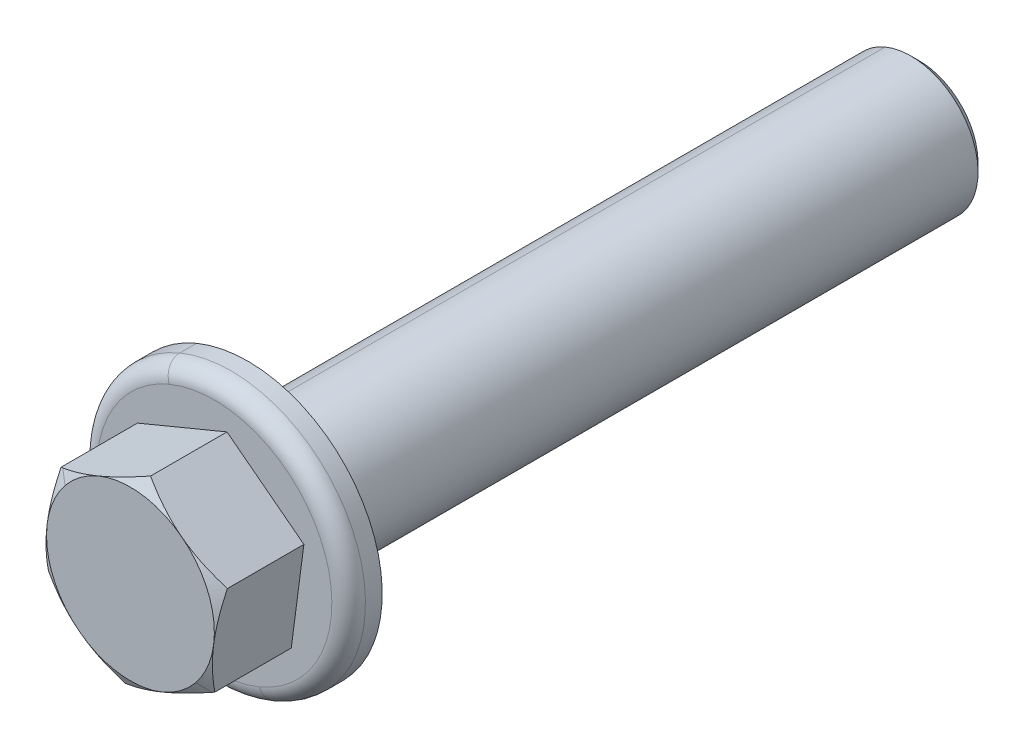
ISO-10303-21;
HEADER;
FILE_DESCRIPTION(('STEP AP214'),'2;1');
FILE_NAME('part.step','',(''),(''),'','','');
FILE_SCHEMA(('AUTOMOTIVE_DESIGN { 1 0 10303 214 1 1 1 1 }'));
ENDSEC;
DATA;
#1=APPLICATION_CONTEXT('core data for automotive mechanical design processes');
#2=APPLICATION_PROTOCOL_DEFINITION('international standard','automotive_design',2000,#1);
#3=PRODUCT_CONTEXT('',#1,'mechanical');
#4=PRODUCT('Part','Part','',(#3));
#5=PRODUCT_RELATED_PRODUCT_CATEGORY('part','',(#4));
#6=PRODUCT_DEFINITION_FORMATION('','',#4);
#7=PRODUCT_DEFINITION_CONTEXT('part definition',#1,'design');
#8=PRODUCT_DEFINITION('design','',#6,#7);
#9=PRODUCT_DEFINITION_SHAPE('','',#8);
#10=(LENGTH_UNIT() NAMED_UNIT(*) SI_UNIT(.MILLI.,.METRE.));
#11=(NAMED_UNIT(*) PLANE_ANGLE_UNIT() SI_UNIT($,.RADIAN.));
#12=(NAMED_UNIT(*) SI_UNIT($,.STERADIAN.) SOLID_ANGLE_UNIT());
#13=UNCERTAINTY_MEASURE_WITH_UNIT(LENGTH_MEASURE(1.E-05),#10,'distance_accuracy_value','');
#14=(GEOMETRIC_REPRESENTATION_CONTEXT(3) GLOBAL_UNCERTAINTY_ASSIGNED_CONTEXT((#13)) GLOBAL_UNIT_ASSIGNED_CONTEXT((#10,
#11,#12)) REPRESENTATION_CONTEXT('',''));
#15=CARTESIAN_POINT('',(0.,0.,0.));
#16=DIRECTION('',(0.,0.,1.));
#17=DIRECTION('',(1.,0.,0.));
#18=AXIS2_PLACEMENT_3D('',#15,#16,#17);
#19=CARTESIAN_POINT('',(104.,10.,26.1));
#20=DIRECTION('',(0.,0.,1.));
#21=DIRECTION('',(0.923728021347068,0.383049008063238,0.));
#22=AXIS2_PLACEMENT_3D('',#19,#20,#21);
#23=TOROIDAL_SURFACE('',#22,4.25,0.25);
#24=CARTESIAN_POINT('',(104.,10.,26.35));
#25=DIRECTION('',(0.,0.,-1.));
#26=DIRECTION('',(-0.923728021347068,-0.383049008063239,0.));
#27=AXIS2_PLACEMENT_3D('',#24,#25,#26);
#28=CIRCLE('',#27,4.25);
#29=CARTESIAN_POINT('',(105.627958284269,6.07415590927496,26.35));
#30=VERTEX_POINT('',#29);
#31=CARTESIAN_POINT('',(102.372041715731,13.925844090725,26.35));
#32=VERTEX_POINT('',#31);
#33=EDGE_CURVE('E11',#30,#32,#28,.T.);
#34=ORIENTED_EDGE('',*,*,#33,.T.);
#35=CARTESIAN_POINT('',(102.372041715731,13.925844090725,26.1));
#36=DIRECTION('',(0.923728021347068,0.383049008063238,0.));
#37=DIRECTION('',(0.,0.,1.));
#38=AXIS2_PLACEMENT_3D('',#35,#36,#37);
#39=CIRCLE('',#38,0.25);
#40=CARTESIAN_POINT('',(102.467803967747,13.6949120853883,26.1));
#41=VERTEX_POINT('',#40);
#42=EDGE_CURVE('E33',#32,#41,#39,.T.);
#43=ORIENTED_EDGE('',*,*,#42,.T.);
#44=CARTESIAN_POINT('',(104.,10.,26.1));
#45=DIRECTION('',(0.,0.,-1.));
#46=DIRECTION('',(-0.923728021347068,-0.383049008063238,0.));
#47=AXIS2_PLACEMENT_3D('',#44,#45,#46);
#48=CIRCLE('',#47,4.);
#49=CARTESIAN_POINT('',(105.532196032253,6.30508791461173,26.1));
#50=VERTEX_POINT('',#49);
#51=EDGE_CURVE('E461',#50,#41,#48,.T.);
#52=ORIENTED_EDGE('',*,*,#51,.F.);
#53=CARTESIAN_POINT('',(105.627958284269,6.07415590927496,26.1));
#54=DIRECTION('',(-0.923728021347068,-0.383049008063238,0.));
#55=DIRECTION('',(0.,0.,1.));
#56=AXIS2_PLACEMENT_3D('',#53,#54,#55);
#57=CIRCLE('',#56,0.25);
#58=EDGE_CURVE('E457',#30,#50,#57,.T.);
#59=ORIENTED_EDGE('',*,*,#58,.F.);
#60=EDGE_LOOP('',(#34,#43,#52,#59));
#61=FACE_BOUND('',#60,.T.);
#62=ADVANCED_FACE('F17',(#61),#23,.F.);
#63=CARTESIAN_POINT('',(104.,10.,26.1));
#64=DIRECTION('',(0.,0.,1.));
#65=DIRECTION('',(-0.383049008063238,0.923728021347068,0.));
#66=AXIS2_PLACEMENT_3D('',#63,#64,#65);
#67=TOROIDAL_SURFACE('',#66,4.25,0.25);
#68=CARTESIAN_POINT('',(104.,10.,26.35));
#69=DIRECTION('',(0.,0.,-1.));
#70=DIRECTION('',(-0.923728021347068,-0.383049008063239,0.));
#71=AXIS2_PLACEMENT_3D('',#68,#69,#70);
#72=CIRCLE('',#71,4.25);
#73=EDGE_CURVE('E454',#32,#30,#72,.T.);
#74=ORIENTED_EDGE('',*,*,#73,.T.);
#75=ORIENTED_EDGE('',*,*,#58,.T.);
#76=CARTESIAN_POINT('',(104.,10.,26.1));
#77=DIRECTION('',(0.,0.,-1.));
#78=DIRECTION('',(-0.923728021347068,-0.383049008063238,0.));
#79=AXIS2_PLACEMENT_3D('',#76,#77,#78);
#80=CIRCLE('',#79,4.);
#81=EDGE_CURVE('E465',#41,#50,#80,.T.);
#82=ORIENTED_EDGE('',*,*,#81,.F.);
#83=ORIENTED_EDGE('',*,*,#42,.F.);
#84=EDGE_LOOP('',(#74,#75,#82,#83));
#85=FACE_BOUND('',#84,.T.);
#86=ADVANCED_FACE('F311',(#85),#67,.F.);
#87=CARTESIAN_POINT('',(104.,10.,6.35));
#88=DIRECTION('',(0.,0.,1.));
#89=DIRECTION('',(0.923728021347068,0.383049008063238,0.));
#90=AXIS2_PLACEMENT_3D('',#87,#88,#89);
#91=CYLINDRICAL_SURFACE('',#90,4.);
#92=DIRECTION('',(0.,0.,-1.));
#93=VECTOR('',#92,1.);
#94=CARTESIAN_POINT('',(105.532196032253,6.30508791461173,6.35));
#95=LINE('',#94,#93);
#96=CARTESIAN_POINT('',(105.532196032253,6.30508791461173,-13.15));
#97=VERTEX_POINT('',#96);
#98=EDGE_CURVE('E468',#50,#97,#95,.T.);
#99=ORIENTED_EDGE('',*,*,#98,.F.);
#100=ORIENTED_EDGE('',*,*,#51,.T.);
#101=DIRECTION('',(0.,0.,-1.));
#102=VECTOR('',#101,1.);
#103=CARTESIAN_POINT('',(102.467803967747,13.6949120853883,6.35));
#104=LINE('',#103,#102);
#105=CARTESIAN_POINT('',(102.467803967747,13.6949120853883,-13.15));
#106=VERTEX_POINT('',#105);
#107=EDGE_CURVE('E472',#41,#106,#104,.T.);
#108=ORIENTED_EDGE('',*,*,#107,.T.);
#109=CARTESIAN_POINT('',(104.,10.,-13.15));
#110=DIRECTION('',(0.,0.,1.));
#111=DIRECTION('',(-0.923728021347068,-0.383049008063238,0.));
#112=AXIS2_PLACEMENT_3D('',#109,#110,#111);
#113=CIRCLE('',#112,4.);
#114=EDGE_CURVE('E467',#106,#97,#113,.T.);
#115=ORIENTED_EDGE('',*,*,#114,.T.);
#116=EDGE_LOOP('',(#99,#100,#108,#115));
#117=FACE_BOUND('',#116,.T.);
#118=ADVANCED_FACE('F317',(#117),#91,.T.);
#119=CARTESIAN_POINT('',(104.,10.,6.35));
#120=DIRECTION('',(0.,0.,1.));
#121=DIRECTION('',(0.923728021347068,0.383049008063238,0.));
#122=AXIS2_PLACEMENT_3D('',#119,#120,#121);
#123=CYLINDRICAL_SURFACE('',#122,4.);
#124=ORIENTED_EDGE('',*,*,#107,.F.);
#125=ORIENTED_EDGE('',*,*,#81,.T.);
#126=ORIENTED_EDGE('',*,*,#98,.T.);
#127=CARTESIAN_POINT('',(104.,10.,-13.15));
#128=DIRECTION('',(0.,0.,1.));
#129=DIRECTION('',(-0.923728021347068,-0.383049008063238,0.));
#130=AXIS2_PLACEMENT_3D('',#127,#128,#129);
#131=CIRCLE('',#130,4.);
#132=EDGE_CURVE('E471',#97,#106,#131,.T.);
#133=ORIENTED_EDGE('',*,*,#132,.T.);
#134=EDGE_LOOP('',(#124,#125,#126,#133));
#135=FACE_BOUND('',#134,.T.);
#136=ADVANCED_FACE('F322',(#135),#123,.T.);
#137=CARTESIAN_POINT('',(104.,10.,-17.15));
#138=DIRECTION('',(0.,0.,1.));
#139=DIRECTION('',(-0.114958388351689,0.993370308066223,0.));
#140=AXIS2_PLACEMENT_3D('',#137,#138,#139);
#141=CONICAL_SURFACE('',#140,0.,0.785398163396999);
#142=DIRECTION('',(0.270856393052956,-0.653174413416782,-0.707106781186537));
#143=VECTOR('',#142,1.);
#144=CARTESIAN_POINT('',(102.563567058084,13.4639804276842,-13.4));
#145=LINE('',#144,#143);
#146=CARTESIAN_POINT('',(102.659328713789,13.2330481750709,-13.65));
#147=VERTEX_POINT('',#146);
#148=EDGE_CURVE('E478',#106,#147,#145,.T.);
#149=ORIENTED_EDGE('',*,*,#148,.T.);
#150=CARTESIAN_POINT('',(104.,10.,-13.65));
#151=DIRECTION('',(0.,0.,1.));
#152=DIRECTION('',(0.993370308066188,0.114958388351986,0.));
#153=AXIS2_PLACEMENT_3D('',#150,#151,#152);
#154=CIRCLE('',#153,3.5);
#155=CARTESIAN_POINT('',(105.340671528221,6.76695192528526,-13.65));
#156=VERTEX_POINT('',#155);
#157=EDGE_CURVE('E481',#147,#156,#154,.T.);
#158=ORIENTED_EDGE('',*,*,#157,.T.);
#159=DIRECTION('',(-0.270856551128283,0.65317434786655,-0.707106781186547));
#160=VECTOR('',#159,1.);
#161=CARTESIAN_POINT('',(105.436433780237,6.53601991994849,-13.4));
#162=LINE('',#161,#160);
#163=EDGE_CURVE('E484',#97,#156,#162,.T.);
#164=ORIENTED_EDGE('',*,*,#163,.F.);
#165=ORIENTED_EDGE('',*,*,#114,.F.);
#166=EDGE_LOOP('',(#149,#158,#164,#165));
#167=FACE_BOUND('',#166,.T.);
#168=ADVANCED_FACE('F326',(#167),#141,.T.);
#169=CARTESIAN_POINT('',(104.,10.0000000000012,-17.15));
#170=DIRECTION('',(-2.07112037355488E-13,-2.99341000002082E-13,1.));
#171=DIRECTION('',(0.383049008063238,-0.923728021347068,-1.97175609173E-13));
#172=AXIS2_PLACEMENT_3D('',#169,#170,#171);
#173=CONICAL_SURFACE('',#172,0.,0.785398163396999);
#174=ORIENTED_EDGE('',*,*,#163,.T.);
#175=CARTESIAN_POINT('',(104.,10.,-13.6499999999993));
#176=DIRECTION('',(-2.8263995886347E-13,-1.17204364682804E-13,1.));
#177=DIRECTION('',(0.923728021347068,0.383049008063238,3.05977465587E-13));
#178=AXIS2_PLACEMENT_3D('',#175,#176,#177);
#179=CIRCLE('',#178,3.5);
#180=EDGE_CURVE('E352',#156,#147,#179,.T.);
#181=ORIENTED_EDGE('',*,*,#180,.T.);
#182=ORIENTED_EDGE('',*,*,#148,.F.);
#183=ORIENTED_EDGE('',*,*,#132,.F.);
#184=EDGE_LOOP('',(#174,#181,#182,#183));
#185=FACE_BOUND('',#184,.T.);
#186=ADVANCED_FACE('F330',(#185),#173,.T.);
#187=CARTESIAN_POINT('',(104.,10.,-13.65));
#188=DIRECTION('',(0.,0.,1.));
#189=DIRECTION('',(-0.383049008063238,0.923728021347068,0.));
#190=AXIS2_PLACEMENT_3D('',#187,#188,#189);
#191=PLANE('',#190);
#192=ORIENTED_EDGE('',*,*,#180,.F.);
#193=ORIENTED_EDGE('',*,*,#157,.F.);
#194=EDGE_LOOP('',(#192,#193));
#195=FACE_BOUND('',#194,.T.);
#196=ADVANCED_FACE('F334',(#195),#191,.F.);
#197=CARTESIAN_POINT('',(104.,10.,33.35));
#198=DIRECTION('',(0.,0.,1.));
#199=DIRECTION('',(0.923728021347068,0.383049008063238,0.));
#200=AXIS2_PLACEMENT_3D('',#197,#198,#199);
#201=PLANE('',#200);
#202=CARTESIAN_POINT('',(104.,10.,33.35));
#203=DIRECTION('',(0.,0.,1.));
#204=DIRECTION('',(-0.923728021347068,-0.383049008063239,0.));
#205=AXIS2_PLACEMENT_3D('',#202,#203,#204);
#206=CIRCLE('',#205,5.);
#207=CARTESIAN_POINT('',(108.95748218353,9.3493308060171,33.3499999999993));
#208=VERTEX_POINT('',#207);
#209=CARTESIAN_POINT('',(107.042237143212,13.9679709127555,33.3499999999992));
#210=VERTEX_POINT('',#209);
#211=EDGE_CURVE('E347',#208,#210,#206,.T.);
#212=ORIENTED_EDGE('',*,*,#211,.T.);
#213=CARTESIAN_POINT('',(104.,10.,33.35));
#214=DIRECTION('',(0.,0.,1.));
#215=DIRECTION('',(-0.923728021347068,-0.383049008063239,0.));
#216=AXIS2_PLACEMENT_3D('',#213,#214,#215);
#217=CIRCLE('',#216,5.);
#218=CARTESIAN_POINT('',(102.084754959684,14.6186401067354,33.35));
#219=VERTEX_POINT('',#218);
#220=EDGE_CURVE('E353',#210,#219,#217,.T.);
#221=ORIENTED_EDGE('',*,*,#220,.T.);
#222=CARTESIAN_POINT('',(104.,10.,33.35));
#223=DIRECTION('',(0.,0.,1.));
#224=DIRECTION('',(-0.923728021347068,-0.383049008063239,0.));
#225=AXIS2_PLACEMENT_3D('',#222,#223,#224);
#226=CIRCLE('',#225,5.);
#227=CARTESIAN_POINT('',(100.104920330083,13.1350206323045,33.35));
#228=VERTEX_POINT('',#227);
#229=EDGE_CURVE('E368',#219,#228,#226,.T.);
#230=ORIENTED_EDGE('',*,*,#229,.T.);
#231=CARTESIAN_POINT('',(104.,10.,33.35));
#232=DIRECTION('',(0.,0.,1.));
#233=DIRECTION('',(-0.923728021347068,-0.383049008063239,0.));
#234=AXIS2_PLACEMENT_3D('',#231,#232,#233);
#235=CIRCLE('',#234,5.);
#236=CARTESIAN_POINT('',(99.0425178164704,10.6506691939829,33.3499999999994));
#237=VERTEX_POINT('',#236);
#238=EDGE_CURVE('E372',#228,#237,#235,.T.);
#239=ORIENTED_EDGE('',*,*,#238,.T.);
#240=CARTESIAN_POINT('',(104.,10.,33.35));
#241=DIRECTION('',(0.,0.,1.));
#242=DIRECTION('',(-0.923728021347068,-0.383049008063239,0.));
#243=AXIS2_PLACEMENT_3D('',#240,#241,#242);
#244=CIRCLE('',#243,5.);
#245=CARTESIAN_POINT('',(100.957762856788,6.03202908724451,33.3499999999993));
#246=VERTEX_POINT('',#245);
#247=EDGE_CURVE('E172',#237,#246,#244,.T.);
#248=ORIENTED_EDGE('',*,*,#247,.T.);
#249=CARTESIAN_POINT('',(104.,10.,33.35));
#250=DIRECTION('',(0.,0.,1.));
#251=DIRECTION('',(-0.923728021347068,-0.383049008063239,0.));
#252=AXIS2_PLACEMENT_3D('',#249,#250,#251);
#253=CIRCLE('',#252,5.);
#254=CARTESIAN_POINT('',(105.915245040316,5.38135989326459,33.35));
#255=VERTEX_POINT('',#254);
#256=EDGE_CURVE('E147',#246,#255,#253,.T.);
#257=ORIENTED_EDGE('',*,*,#256,.T.);
#258=CARTESIAN_POINT('',(104.,10.,33.35));
#259=DIRECTION('',(0.,0.,1.));
#260=DIRECTION('',(-0.923728021347068,-0.383049008063239,0.));
#261=AXIS2_PLACEMENT_3D('',#258,#259,#260);
#262=CIRCLE('',#261,5.);
#263=CARTESIAN_POINT('',(107.895079669917,6.86497936769553,33.35));
#264=VERTEX_POINT('',#263);
#265=EDGE_CURVE('E160',#255,#264,#262,.T.);
#266=ORIENTED_EDGE('',*,*,#265,.T.);
#267=CARTESIAN_POINT('',(104.,10.,33.35));
#268=DIRECTION('',(0.,0.,1.));
#269=DIRECTION('',(-0.923728021347068,-0.383049008063239,0.));
#270=AXIS2_PLACEMENT_3D('',#267,#268,#269);
#271=CIRCLE('',#270,5.);
#272=EDGE_CURVE('E166',#264,#208,#271,.T.);
#273=ORIENTED_EDGE('',*,*,#272,.T.);
#274=EDGE_LOOP('',(#212,#221,#230,#239,#248,#257,#266,#273));
#275=FACE_BOUND('',#274,.T.);
#276=ADVANCED_FACE('F169',(#275),#201,.T.);
#277=CARTESIAN_POINT('',(104.,10.,33.35));
#278=DIRECTION('',(0.,0.,-1.));
#279=DIRECTION('',(0.779015933983816,-0.62700412646116,0.));
#280=AXIS2_PLACEMENT_3D('',#277,#278,#279);
#281=CONICAL_SURFACE('',#280,5.,1.0471975512);
#282=ORIENTED_EDGE('',*,*,#211,.F.);
#283=CARTESIAN_POINT('',(109.333146217831,12.2115344791841,32.9034180126157));
#284=CARTESIAN_POINT('',(109.3025673255,11.9785523197016,32.9712680083951));
#285=CARTESIAN_POINT('',(109.271743546411,11.7437043553627,33.0334304503107));
#286=CARTESIAN_POINT('',(109.209824279666,11.2719382650976,33.1430527974047));
#287=CARTESIAN_POINT('',(109.178730951812,11.0350365947981,33.1905854034298));
#288=CARTESIAN_POINT('',(109.131797514476,10.677448312528,33.2489473736346));
#289=CARTESIAN_POINT('',(109.11609374839,10.557800507916,33.2662522919641));
#290=CARTESIAN_POINT('',(109.084611035887,10.3179320958806,33.2962074663214));
#291=CARTESIAN_POINT('',(109.068832091461,10.1977115036178,33.3088578448603));
#292=CARTESIAN_POINT('',(109.037140657916,9.95625283518837,33.3292816727013));
#293=CARTESIAN_POINT('',(109.021227896041,9.83501268087028,33.3370303207408));
#294=CARTESIAN_POINT('',(108.989371077041,9.59229393211747,33.3474002095296));
#295=CARTESIAN_POINT('',(108.973427014344,9.47081529522707,33.3500204348121));
#296=CARTESIAN_POINT('',(108.957482183531,9.34933080601693,33.3499999999985));
#297=B_SPLINE_CURVE_WITH_KNOTS('',3,(#283,#284,#285,#286,#287,#288,#289,#290,#291,#292,#293,
#294,#295,#296),.UNSPECIFIED.,.F.,.F.,(4,2,2,2,2,2,4),(0.,0.734036658391592,1.46436443241699,
1.8300074907837,2.1956409244586,2.56310985866725,2.93065154716807),.UNSPECIFIED.);
#298=CARTESIAN_POINT('',(109.333146217831,12.211534479183,32.9034180126157));
#299=VERTEX_POINT('',#298);
#300=EDGE_CURVE('E218',#299,#208,#297,.T.);
#301=ORIENTED_EDGE('',*,*,#300,.F.);
#302=CARTESIAN_POINT('',(107.042237143213,13.9679709127566,33.3499999999985));
#303=CARTESIAN_POINT('',(107.139473381628,13.8934200396083,33.3500204348121));
#304=CARTESIAN_POINT('',(107.236704935844,13.8188727578283,33.3474002095296));
#305=CARTESIAN_POINT('',(107.430977128739,13.6699245689144,33.3370303207408));
#306=CARTESIAN_POINT('',(107.5280178014,13.5955236357268,33.3292816727013));
#307=CARTESIAN_POINT('',(107.721281425451,13.4473487149803,33.3088578448603));
#308=CARTESIAN_POINT('',(107.817506040196,13.373573452131,33.2962074663214));
#309=CARTESIAN_POINT('',(108.009496822333,13.226374417306,33.2662522919641));
#310=CARTESIAN_POINT('',(108.10526297759,13.1529506546339,33.2489473736346));
#311=CARTESIAN_POINT('',(108.391476795464,12.9335109644795,33.1905854034297));
#312=CARTESIAN_POINT('',(108.581092996215,12.7881325175194,33.1430527974047));
#313=CARTESIAN_POINT('',(108.958694781657,12.4986258144028,33.0334304503107));
#314=CARTESIAN_POINT('',(109.146667195257,12.3545076565013,32.9712680083951));
#315=CARTESIAN_POINT('',(109.333146217832,12.211534479182,32.9034180126156));
#316=B_SPLINE_CURVE_WITH_KNOTS('',3,(#302,#303,#304,#305,#306,#307,#308,#309,#310,#311,#312,
#313,#314,#315),.UNSPECIFIED.,.F.,.F.,(4,2,2,2,2,2,4),(0.,0.36754168850086,0.735010622709554,
1.10064405638449,1.46628711475127,2.19661488877674,2.93065154716843),.UNSPECIFIED.);
#317=EDGE_CURVE('E234',#210,#299,#316,.T.);
#318=ORIENTED_EDGE('',*,*,#317,.F.);
#319=EDGE_LOOP('',(#282,#301,#318));
#320=FACE_BOUND('',#319,.T.);
#321=ADVANCED_FACE('F248',(#320),#281,.T.);
#322=CARTESIAN_POINT('',(104.,10.,33.35));
#323=DIRECTION('',(0.,0.,-1.));
#324=DIRECTION('',(0.779015933983816,-0.62700412646116,0.));
#325=AXIS2_PLACEMENT_3D('',#322,#323,#324);
#326=CONICAL_SURFACE('',#325,5.,1.0471975512);
#327=ORIENTED_EDGE('',*,*,#220,.F.);
#328=CARTESIAN_POINT('',(104.751328068599,15.7244073463278,32.9034180126172));
#329=CARTESIAN_POINT('',(104.937807091173,15.5814341690087,32.9712680083964));
#330=CARTESIAN_POINT('',(105.125779504773,15.4373160111075,33.0334304503118));
#331=CARTESIAN_POINT('',(105.503381290214,15.1478093079915,33.1430527974054));
#332=CARTESIAN_POINT('',(105.692997490964,15.0024308610316,33.1905854034303));
#333=CARTESIAN_POINT('',(105.979211308838,14.7829911708776,33.248947373635));
#334=CARTESIAN_POINT('',(106.074977464095,14.7095674082057,33.2662522919644));
#335=CARTESIAN_POINT('',(106.266968246232,14.562368373381,33.2962074663216));
#336=CARTESIAN_POINT('',(106.363192860976,14.4885931105318,33.3088578448604));
#337=CARTESIAN_POINT('',(106.556456485027,14.3404181897856,33.3292816727013));
#338=CARTESIAN_POINT('',(106.653497157688,14.2660172565982,33.3370303207408));
#339=CARTESIAN_POINT('',(106.847769350582,14.1170690676846,33.3474002095296));
#340=CARTESIAN_POINT('',(106.945000904798,14.0425217859048,33.3500204348121));
#341=CARTESIAN_POINT('',(107.042237143213,13.9679709127566,33.3499999999985));
#342=B_SPLINE_CURVE_WITH_KNOTS('',3,(#328,#329,#330,#331,#332,#333,#334,#335,#336,#337,#338,
#339,#340,#341),.UNSPECIFIED.,.F.,.F.,(4,2,2,2,2,2,4),(0.,0.734036658390187,1.46436443241421,
1.83000749078021,2.19564092445442,2.56310985866234,2.93065154716248),.UNSPECIFIED.);
#343=CARTESIAN_POINT('',(104.7513280686,15.7244073463277,32.9034180126172));
#344=VERTEX_POINT('',#343);
#345=EDGE_CURVE('E225',#344,#210,#342,.T.);
#346=ORIENTED_EDGE('',*,*,#345,.F.);
#347=CARTESIAN_POINT('',(102.084754959684,14.6186401067355,33.35));
#348=CARTESIAN_POINT('',(102.197936028912,14.6655737227973,33.3500204348137));
#349=CARTESIAN_POINT('',(102.311111645825,14.7125050779077,33.3474002095312));
#350=CARTESIAN_POINT('',(102.537240657719,14.8062756377465,33.3370303207423));
#351=CARTESIAN_POINT('',(102.650194092255,14.853114858877,33.3292816727028));
#352=CARTESIAN_POINT('',(102.875149149851,14.9463986065599,33.3088578448618));
#353=CARTESIAN_POINT('',(102.987152709022,14.9928439359733,33.2962074663229));
#354=CARTESIAN_POINT('',(103.210626203661,15.0855133131837,33.2662522919656));
#355=CARTESIAN_POINT('',(103.322096125006,15.1317373551237,33.2489473736361));
#356=CARTESIAN_POINT('',(103.655243380215,15.2698859472393,33.1905854034312));
#357=CARTESIAN_POINT('',(103.87595290882,15.3614091705786,33.1430527974062));
#358=CARTESIAN_POINT('',(104.315473961006,15.5436685577271,33.0334304503122));
#359=CARTESIAN_POINT('',(104.534270153695,15.6343983641645,32.9712680083965));
#360=CARTESIAN_POINT('',(104.751328068601,15.7244073463275,32.9034180126171));
#361=B_SPLINE_CURVE_WITH_KNOTS('',3,(#347,#348,#349,#350,#351,#352,#353,#354,#355,#356,#357,
#358,#359,#360),.UNSPECIFIED.,.F.,.F.,(4,2,2,2,2,2,4),(0.,0.367541688500738,0.735010622709312,
1.10064405638414,1.46628711475077,2.19661488877601,2.93065154716746),.UNSPECIFIED.);
#362=EDGE_CURVE('E256',#219,#344,#361,.T.);
#363=ORIENTED_EDGE('',*,*,#362,.F.);
#364=EDGE_LOOP('',(#327,#346,#363));
#365=FACE_BOUND('',#364,.T.);
#366=ADVANCED_FACE('F243',(#365),#326,.T.);
#367=CARTESIAN_POINT('',(104.,10.,33.35));
#368=DIRECTION('',(0.,0.,-1.));
#369=DIRECTION('',(0.779015933983816,-0.62700412646116,0.));
#370=AXIS2_PLACEMENT_3D('',#367,#368,#369);
#371=CONICAL_SURFACE('',#370,5.,1.0471975512);
#372=DIRECTION('',(0.674647588782705,-0.543001501793055,0.500000000000169));
#373=VECTOR('',#372,1.);
#374=CARTESIAN_POINT('',(98.3669224154155,14.5338775962476,32.0619216436));
#375=LINE('',#374,#373);
#376=CARTESIAN_POINT('',(99.5615803696797,13.5723369725487,32.947315717563));
#377=VERTEX_POINT('',#376);
#378=EDGE_CURVE('E359',#377,#228,#375,.T.);
#379=ORIENTED_EDGE('',*,*,#378,.T.);
#380=ORIENTED_EDGE('',*,*,#229,.F.);
#381=CARTESIAN_POINT('',(99.5615803696752,13.5723369725545,32.9473157175507));
#382=CARTESIAN_POINT('',(99.7673217148021,13.6576532305251,33.0089939702822));
#383=CARTESIAN_POINT('',(99.9746224299532,13.743616123793,33.0652901400361));
#384=CARTESIAN_POINT('',(100.390932907383,13.9162506133173,33.164327519033));
#385=CARTESIAN_POINT('',(100.599930196708,14.0029170373233,33.2071306974177));
#386=CARTESIAN_POINT('',(100.915212095264,14.1336572722318,33.2595623012601));
#387=CARTESIAN_POINT('',(101.02066262896,14.1773852109739,33.275082637656));
#388=CARTESIAN_POINT('',(101.232020427228,14.2650304843684,33.3019229351795));
#389=CARTESIAN_POINT('',(101.337927683107,14.3089478154156,33.3132429759078));
#390=CARTESIAN_POINT('',(101.550560143613,14.3971216622587,33.3315033490443));
#391=CARTESIAN_POINT('',(101.657286864002,14.4413788066065,33.3384231328081));
#392=CARTESIAN_POINT('',(101.870925975233,14.5299700886173,33.3476799879821));
#393=CARTESIAN_POINT('',(101.977838392784,14.574304237356,33.3500163340106));
#394=CARTESIAN_POINT('',(102.084754959684,14.6186401067355,33.35));
#395=B_SPLINE_CURVE_WITH_KNOTS('',3,(#381,#382,#383,#384,#385,#386,#387,#388,#389,#390,#391,
#392,#393,#394),.UNSPECIFIED.,.F.,.F.,(4,2,2,2,2,2,4),(0.,0.6935727097251,1.38391201165256,
1.7294646913559,2.07501082206955,2.42215898329313,2.7693620802709),.UNSPECIFIED.);
#396=EDGE_CURVE('E262',#377,#219,#395,.T.);
#397=ORIENTED_EDGE('',*,*,#396,.F.);
#398=EDGE_LOOP('',(#379,#380,#397));
#399=FACE_BOUND('',#398,.T.);
#400=ADVANCED_FACE('F247',(#399),#371,.T.);
#401=CARTESIAN_POINT('',(104.,10.,33.35));
#402=DIRECTION('',(0.,0.,-1.));
#403=DIRECTION('',(0.779015933983816,-0.62700412646116,0.));
#404=AXIS2_PLACEMENT_3D('',#401,#402,#403);
#405=CONICAL_SURFACE('',#404,5.,1.0471975512);
#406=ORIENTED_EDGE('',*,*,#238,.F.);
#407=ORIENTED_EDGE('',*,*,#378,.F.);
#408=CARTESIAN_POINT('',(99.5615803696809,13.5723369725492,32.9473157175));
#409=CARTESIAN_POINT('',(99.5144006273216,13.5527726060974,32.9331782382));
#410=CARTESIAN_POINT('',(99.466617991441,13.5329582334101,32.9185548376));
#411=CARTESIAN_POINT('',(99.4181818507684,13.512872867144,32.9034180126));
#412=B_SPLINE_CURVE_WITH_KNOTS('',3,(#408,#409,#410,#411),.UNSPECIFIED.,.F.,.F.,(4,4),(0.,1.),.UNSPECIFIED.);
#413=CARTESIAN_POINT('',(99.4181818507687,13.5128728671463,32.9034180126082));
#414=VERTEX_POINT('',#413);
#415=EDGE_CURVE('E362',#377,#414,#412,.T.);
#416=ORIENTED_EDGE('',*,*,#415,.T.);
#417=CARTESIAN_POINT('',(99.0425178164693,10.650669193983,33.3499999999987));
#418=CARTESIAN_POINT('',(99.0584626472825,10.7721536831931,33.3500204348124));
#419=CARTESIAN_POINT('',(99.0744067099791,10.8936323200835,33.3474002095299));
#420=CARTESIAN_POINT('',(99.1062635289789,11.1363510688361,33.3370303207411));
#421=CARTESIAN_POINT('',(99.1221762908544,11.2575912231542,33.3292816727016));
#422=CARTESIAN_POINT('',(99.1538677243988,11.4990498915834,33.3088578448606));
#423=CARTESIAN_POINT('',(99.169646668825,11.6192704838461,33.2962074663217));
#424=CARTESIAN_POINT('',(99.2011293813276,11.8591388958814,33.2662522919645));
#425=CARTESIAN_POINT('',(99.2168331474143,11.9787867004934,33.248947373635));
#426=CARTESIAN_POINT('',(99.2637665847497,12.3363749827633,33.1905854034302));
#427=CARTESIAN_POINT('',(99.2948599126046,12.5732766530627,33.1430527974052));
#428=CARTESIAN_POINT('',(99.3567791793486,13.0450427433275,33.0334304503113));
#429=CARTESIAN_POINT('',(99.387602958438,13.2798907076663,32.9712680083957));
#430=CARTESIAN_POINT('',(99.418181850769,13.5128728671486,32.9034180126164));
#431=B_SPLINE_CURVE_WITH_KNOTS('',3,(#417,#418,#419,#420,#421,#422,#423,#424,#425,#426,#427,
#428,#429,#430),.UNSPECIFIED.,.F.,.F.,(4,2,2,2,2,2,4),(0.,0.367541688500622,0.735010622709061,
1.10064405638375,1.46628711475027,2.19661488877527,2.93065154716645),.UNSPECIFIED.);
#432=EDGE_CURVE('E287',#237,#414,#431,.T.);
#433=ORIENTED_EDGE('',*,*,#432,.F.);
#434=EDGE_LOOP('',(#406,#407,#416,#433));
#435=FACE_BOUND('',#434,.T.);
#436=ADVANCED_FACE('F297',(#435),#405,.T.);
#437=CARTESIAN_POINT('',(104.,10.,33.35));
#438=DIRECTION('',(0.,0.,-1.));
#439=DIRECTION('',(0.779015933983816,-0.62700412646116,0.));
#440=AXIS2_PLACEMENT_3D('',#437,#438,#439);
#441=CONICAL_SURFACE('',#440,5.,1.0471975512);
#442=ORIENTED_EDGE('',*,*,#247,.F.);
#443=CARTESIAN_POINT('',(98.6668537821694,7.78846552081587,32.9034180126159));
#444=CARTESIAN_POINT('',(98.6974326745004,8.02144768029834,32.9712680083953));
#445=CARTESIAN_POINT('',(98.7282564535898,8.25629564463727,33.0334304503109));
#446=CARTESIAN_POINT('',(98.7901757203339,8.72806173490236,33.1430527974049));
#447=CARTESIAN_POINT('',(98.8212690481888,8.96496340520186,33.19058540343));
#448=CARTESIAN_POINT('',(98.8682024855243,9.32255168747195,33.2489473736349));
#449=CARTESIAN_POINT('',(98.8839062516109,9.44219949208399,33.2662522919644));
#450=CARTESIAN_POINT('',(98.9153889641135,9.68206790411939,33.2962074663217));
#451=CARTESIAN_POINT('',(98.9311679085397,9.80228849638217,33.3088578448605));
#452=CARTESIAN_POINT('',(98.9628593420842,10.0437471648116,33.3292816727015));
#453=CARTESIAN_POINT('',(98.9787721039597,10.1649873191297,33.3370303207411));
#454=CARTESIAN_POINT('',(99.0106289229595,10.4077060678825,33.3474002095299));
#455=CARTESIAN_POINT('',(99.0265729856561,10.5291847047729,33.3500204348124));
#456=CARTESIAN_POINT('',(99.0425178164693,10.650669193983,33.3499999999987));
#457=B_SPLINE_CURVE_WITH_KNOTS('',3,(#443,#444,#445,#446,#447,#448,#449,#450,#451,#452,#453,
#454,#455,#456),.UNSPECIFIED.,.F.,.F.,(4,2,2,2,2,2,4),(0.,0.734036658391598,1.46436443241701,
1.83000749078372,2.19564092445863,2.56310985866727,2.9306515471681),.UNSPECIFIED.);
#458=CARTESIAN_POINT('',(98.6668537821689,7.78846552081692,32.9034180126159));
#459=VERTEX_POINT('',#458);
#460=EDGE_CURVE('E268',#459,#237,#457,.T.);
#461=ORIENTED_EDGE('',*,*,#460,.F.);
#462=CARTESIAN_POINT('',(100.957762856787,6.03202908724346,33.3499999999985));
#463=CARTESIAN_POINT('',(100.860526618372,6.10657996039178,33.3500204348122));
#464=CARTESIAN_POINT('',(100.763295064156,6.18112724217176,33.3474002095297));
#465=CARTESIAN_POINT('',(100.569022871261,6.3300754310857,33.3370303207409));
#466=CARTESIAN_POINT('',(100.471982198601,6.40447636427326,33.3292816727013));
#467=CARTESIAN_POINT('',(100.278718574549,6.55265128501973,33.3088578448604));
#468=CARTESIAN_POINT('',(100.182493959804,6.62642654786907,33.2962074663215));
#469=CARTESIAN_POINT('',(99.9905031776675,6.77362558269401,33.2662522919642));
#470=CARTESIAN_POINT('',(99.8947370224098,6.84704934536609,33.2489473736347));
#471=CARTESIAN_POINT('',(99.6085232045359,7.06648903552045,33.1905854034298));
#472=CARTESIAN_POINT('',(99.4189070037849,7.21186748248061,33.1430527974048));
#473=CARTESIAN_POINT('',(99.0413052183432,7.50137418559712,33.0334304503108));
#474=CARTESIAN_POINT('',(98.8533328047433,7.64549234349859,32.9712680083952));
#475=CARTESIAN_POINT('',(98.6668537821683,7.78846552081796,32.9034180126158));
#476=B_SPLINE_CURVE_WITH_KNOTS('',3,(#462,#463,#464,#465,#466,#467,#468,#469,#470,#471,#472,
#473,#474,#475),.UNSPECIFIED.,.F.,.F.,(4,2,2,2,2,2,4),(0.,0.367541688500833,0.735010622709478,
1.1006440563844,1.4662871147511,2.1966148887765,2.93065154716811),.UNSPECIFIED.);
#477=EDGE_CURVE('E188',#246,#459,#476,.T.);
#478=ORIENTED_EDGE('',*,*,#477,.F.);
#479=EDGE_LOOP('',(#442,#461,#478));
#480=FACE_BOUND('',#479,.T.);
#481=ADVANCED_FACE('F300',(#480),#441,.T.);
#482=CARTESIAN_POINT('',(104.,10.,33.35));
#483=DIRECTION('',(0.,0.,-1.));
#484=DIRECTION('',(0.779015933983816,-0.62700412646116,0.));
#485=AXIS2_PLACEMENT_3D('',#482,#483,#484);
#486=CONICAL_SURFACE('',#485,5.,1.0471975512);
#487=ORIENTED_EDGE('',*,*,#256,.F.);
#488=CARTESIAN_POINT('',(103.248671931401,4.2755926536723,32.9034180126172));
#489=CARTESIAN_POINT('',(103.062192908827,4.41856583099143,32.9712680083964));
#490=CARTESIAN_POINT('',(102.874220495227,4.56268398889265,33.0334304503118));
#491=CARTESIAN_POINT('',(102.496618709786,4.85219069200863,33.1430527974055));
#492=CARTESIAN_POINT('',(102.307002509036,4.99756913896852,33.1905854034303));
#493=CARTESIAN_POINT('',(102.020788691162,5.21700882912247,33.248947373635));
#494=CARTESIAN_POINT('',(101.925022535905,5.29043259179441,33.2662522919645));
#495=CARTESIAN_POINT('',(101.733031753768,5.43763162661908,33.2962074663217));
#496=CARTESIAN_POINT('',(101.636807139024,5.51140688946827,33.3088578448605));
#497=CARTESIAN_POINT('',(101.443543514973,5.65958181021445,33.3292816727014));
#498=CARTESIAN_POINT('',(101.346502842312,5.73398274340187,33.3370303207409));
#499=CARTESIAN_POINT('',(101.152230649418,5.88293093231551,33.3474002095297));
#500=CARTESIAN_POINT('',(101.054999095202,5.95747821409533,33.3500204348122));
#501=CARTESIAN_POINT('',(100.957762856787,6.03202908724346,33.3499999999985));
#502=B_SPLINE_CURVE_WITH_KNOTS('',3,(#488,#489,#490,#491,#492,#493,#494,#495,#496,#497,#498,
#499,#500,#501),.UNSPECIFIED.,.F.,.F.,(4,2,2,2,2,2,4),(0.,0.734036658390166,1.46436443241419,
1.83000749078021,2.1956409244544,2.56310985866234,2.93065154716245),.UNSPECIFIED.);
#503=CARTESIAN_POINT('',(103.2486719314,4.27559265367239,32.9034180126172));
#504=VERTEX_POINT('',#503);
#505=EDGE_CURVE('E150',#504,#246,#502,.T.);
#506=ORIENTED_EDGE('',*,*,#505,.F.);
#507=CARTESIAN_POINT('',(105.915245040316,5.38135989326452,33.35));
#508=CARTESIAN_POINT('',(105.802063971088,5.33442627720269,33.3500204348136));
#509=CARTESIAN_POINT('',(105.688888354175,5.28749492209229,33.3474002095311));
#510=CARTESIAN_POINT('',(105.462759342281,5.19372436225346,33.3370303207423));
#511=CARTESIAN_POINT('',(105.349805907745,5.14688514112295,33.3292816727028));
#512=CARTESIAN_POINT('',(105.124850850149,5.05360139344006,33.3088578448618));
#513=CARTESIAN_POINT('',(105.012847290978,5.00715606402664,33.2962074663229));
#514=CARTESIAN_POINT('',(104.789373796339,4.91448668681625,33.2662522919656));
#515=CARTESIAN_POINT('',(104.677903874994,4.86826264487632,33.2489473736361));
#516=CARTESIAN_POINT('',(104.344756619785,4.73011405276068,33.1905854034312));
#517=CARTESIAN_POINT('',(104.12404709118,4.63859082942138,33.1430527974062));
#518=CARTESIAN_POINT('',(103.684526038994,4.45633144227291,33.0334304503121));
#519=CARTESIAN_POINT('',(103.465729846305,4.36560163583552,32.9712680083965));
#520=CARTESIAN_POINT('',(103.248671931399,4.27559265367248,32.9034180126171));
#521=B_SPLINE_CURVE_WITH_KNOTS('',3,(#507,#508,#509,#510,#511,#512,#513,#514,#515,#516,#517,
#518,#519,#520),.UNSPECIFIED.,.F.,.F.,(4,2,2,2,2,2,4),(0.,0.367541688500748,0.735010622709322,
1.10064405638415,1.46628711475078,2.19661488877604,2.93065154716745),.UNSPECIFIED.);
#522=EDGE_CURVE('E21',#255,#504,#521,.T.);
#523=ORIENTED_EDGE('',*,*,#522,.F.);
#524=EDGE_LOOP('',(#487,#506,#523));
#525=FACE_BOUND('',#524,.T.);
#526=ADVANCED_FACE('F145',(#525),#486,.T.);
#527=CARTESIAN_POINT('',(104.,10.,33.35));
#528=DIRECTION('',(0.,0.,-1.));
#529=DIRECTION('',(0.779015933983816,-0.62700412646116,0.));
#530=AXIS2_PLACEMENT_3D('',#527,#528,#529);
#531=CONICAL_SURFACE('',#530,5.,1.0471975512);
#532=DIRECTION('',(-0.674647588782705,0.543001501793055,0.500000000000169));
#533=VECTOR('',#532,1.);
#534=CARTESIAN_POINT('',(109.633077584584,5.46612240375236,32.0619216436));
#535=LINE('',#534,#533);
#536=CARTESIAN_POINT('',(108.43841963032,6.42766302745122,32.9473157175629));
#537=VERTEX_POINT('',#536);
#538=EDGE_CURVE('E163',#537,#264,#535,.T.);
#539=ORIENTED_EDGE('',*,*,#538,.T.);
#540=ORIENTED_EDGE('',*,*,#265,.F.);
#541=CARTESIAN_POINT('',(108.438419630325,6.42766302744553,32.9473157175507));
#542=CARTESIAN_POINT('',(108.232678285198,6.34234676947498,33.0089939702821));
#543=CARTESIAN_POINT('',(108.025377570047,6.25638387620706,33.0652901400361));
#544=CARTESIAN_POINT('',(107.609067092617,6.0837493866827,33.1643275190329));
#545=CARTESIAN_POINT('',(107.400069803292,5.99708296267675,33.2071306974177));
#546=CARTESIAN_POINT('',(107.084787904736,5.86634272776825,33.25956230126));
#547=CARTESIAN_POINT('',(106.97933737104,5.82261478902614,33.275082637656));
#548=CARTESIAN_POINT('',(106.767979572772,5.73496951563163,33.3019229351795));
#549=CARTESIAN_POINT('',(106.662072316893,5.69105218458441,33.3132429759078));
#550=CARTESIAN_POINT('',(106.449439856387,5.60287833774133,33.3315033490443));
#551=CARTESIAN_POINT('',(106.342713135998,5.55862119339354,33.3384231328081));
#552=CARTESIAN_POINT('',(106.129074024767,5.47002991138274,33.3476799879821));
#553=CARTESIAN_POINT('',(106.022161607216,5.42569576264397,33.3500163340106));
#554=CARTESIAN_POINT('',(105.915245040316,5.38135989326453,33.35));
#555=B_SPLINE_CURVE_WITH_KNOTS('',3,(#541,#542,#543,#544,#545,#546,#547,#548,#549,#550,#551,
#552,#553,#554),.UNSPECIFIED.,.F.,.F.,(4,2,2,2,2,2,4),(0.,0.693572709725134,1.38391201165266,
1.72946469135601,2.07501082206967,2.42215898329328,2.76936208027107),.UNSPECIFIED.);
#556=EDGE_CURVE('E155',#537,#255,#555,.T.);
#557=ORIENTED_EDGE('',*,*,#556,.F.);
#558=EDGE_LOOP('',(#539,#540,#557));
#559=FACE_BOUND('',#558,.T.);
#560=ADVANCED_FACE('F161',(#559),#531,.T.);
#561=CARTESIAN_POINT('',(104.,10.,33.35));
#562=DIRECTION('',(0.,0.,-1.));
#563=DIRECTION('',(0.779015933983816,-0.62700412646116,0.));
#564=AXIS2_PLACEMENT_3D('',#561,#562,#563);
#565=CONICAL_SURFACE('',#564,5.,1.0471975512);
#566=ORIENTED_EDGE('',*,*,#272,.F.);
#567=ORIENTED_EDGE('',*,*,#538,.F.);
#568=CARTESIAN_POINT('',(108.438419630319,6.42766302745077,32.9473157175));
#569=CARTESIAN_POINT('',(108.485599372678,6.44722739390256,32.9331782382));
#570=CARTESIAN_POINT('',(108.533382008559,6.46704176658989,32.9185548376));
#571=CARTESIAN_POINT('',(108.581818149232,6.48712713285602,32.9034180126));
#572=B_SPLINE_CURVE_WITH_KNOTS('',3,(#568,#569,#570,#571),.UNSPECIFIED.,.F.,.F.,(4,4),(0.,1.),.UNSPECIFIED.);
#573=CARTESIAN_POINT('',(108.581818149232,6.48712713285366,32.9034180126081));
#574=VERTEX_POINT('',#573);
#575=EDGE_CURVE('E178',#537,#574,#572,.T.);
#576=ORIENTED_EDGE('',*,*,#575,.T.);
#577=CARTESIAN_POINT('',(108.957482183531,9.34933080601693,33.3499999999985));
#578=CARTESIAN_POINT('',(108.941537352718,9.22784631680685,33.3500204348121));
#579=CARTESIAN_POINT('',(108.925593290021,9.1063676799165,33.3474002095296));
#580=CARTESIAN_POINT('',(108.893736471021,8.86364893116382,33.3370303207408));
#581=CARTESIAN_POINT('',(108.877823709146,8.7424087768458,33.3292816727013));
#582=CARTESIAN_POINT('',(108.846132275602,8.50095010841652,33.3088578448604));
#583=CARTESIAN_POINT('',(108.830353331175,8.38072951615382,33.2962074663215));
#584=CARTESIAN_POINT('',(108.798870618673,8.14086110411854,33.2662522919642));
#585=CARTESIAN_POINT('',(108.783166852586,8.02121329950657,33.2489473736348));
#586=CARTESIAN_POINT('',(108.736233415251,7.66362501723668,33.1905854034299));
#587=CARTESIAN_POINT('',(108.705140087396,7.42672334693729,33.143052797405));
#588=CARTESIAN_POINT('',(108.643220820652,6.95495725667245,33.033430450311));
#589=CARTESIAN_POINT('',(108.612397041562,6.72010929233366,32.9712680083955));
#590=CARTESIAN_POINT('',(108.581818149231,6.4871271328513,32.9034180126162));
#591=B_SPLINE_CURVE_WITH_KNOTS('',3,(#577,#578,#579,#580,#581,#582,#583,#584,#585,#586,#587,
#588,#589,#590),.UNSPECIFIED.,.F.,.F.,(4,2,2,2,2,2,4),(0.,0.36754168850062,0.73501062270906,
1.10064405638376,1.46628711475027,2.19661488877528,2.93065154716646),.UNSPECIFIED.);
#592=EDGE_CURVE('E211',#208,#574,#591,.T.);
#593=ORIENTED_EDGE('',*,*,#592,.F.);
#594=EDGE_LOOP('',(#566,#567,#576,#593));
#595=FACE_BOUND('',#594,.T.);
#596=ADVANCED_FACE('F201',(#595),#565,.T.);
#597=CARTESIAN_POINT('',(108.581818149232,6.48712713285602,26.35));
#598=DIRECTION('',(0.991496436705686,-0.130133838796557,0.));
#599=DIRECTION('',(-0.130133838796557,-0.991496436705686,0.));
#600=AXIS2_PLACEMENT_3D('',#597,#598,#599);
#601=PLANE('',#600);
#602=DIRECTION('',(0.,0.,1.));
#603=VECTOR('',#602,1.);
#604=CARTESIAN_POINT('',(109.333146217831,12.2115344791827,30.6267090063));
#605=LINE('',#604,#603);
#606=CARTESIAN_POINT('',(109.333146217831,12.2115344791827,28.35));
#607=VERTEX_POINT('',#606);
#608=EDGE_CURVE('E358',#607,#299,#605,.T.);
#609=ORIENTED_EDGE('',*,*,#608,.T.);
#610=ORIENTED_EDGE('',*,*,#300,.T.);
#611=ORIENTED_EDGE('',*,*,#592,.T.);
#612=DIRECTION('',(0.,0.,1.));
#613=VECTOR('',#612,1.);
#614=CARTESIAN_POINT('',(108.581818149232,6.48712713285602,30.6267090063));
#615=LINE('',#614,#613);
#616=CARTESIAN_POINT('',(108.581818149232,6.48712713285602,28.35));
#617=VERTEX_POINT('',#616);
#618=EDGE_CURVE('E179',#617,#574,#615,.T.);
#619=ORIENTED_EDGE('',*,*,#618,.F.);
#620=DIRECTION('',(0.130133838796557,0.991496436705686,0.));
#621=VECTOR('',#620,1.);
#622=CARTESIAN_POINT('',(108.957482183526,9.34933080601746,28.35));
#623=LINE('',#622,#621);
#624=EDGE_CURVE('E219',#617,#607,#623,.T.);
#625=ORIENTED_EDGE('',*,*,#624,.T.);
#626=EDGE_LOOP('',(#609,#610,#611,#619,#625));
#627=FACE_BOUND('',#626,.T.);
#628=ADVANCED_FACE('F206',(#627),#601,.T.);
#629=CARTESIAN_POINT('',(109.333146217831,12.2115344791827,26.35));
#630=DIRECTION('',(0.608447428642302,0.793594182550862,0.));
#631=DIRECTION('',(0.793594182550862,-0.608447428642302,0.));
#632=AXIS2_PLACEMENT_3D('',#629,#630,#631);
#633=PLANE('',#632);
#634=DIRECTION('',(0.,0.,1.));
#635=VECTOR('',#634,1.);
#636=CARTESIAN_POINT('',(104.751328068599,15.7244073463267,30.6267090063));
#637=LINE('',#636,#635);
#638=CARTESIAN_POINT('',(104.751328068599,15.7244073463267,28.35));
#639=VERTEX_POINT('',#638);
#640=EDGE_CURVE('E233',#639,#344,#637,.T.);
#641=ORIENTED_EDGE('',*,*,#640,.T.);
#642=ORIENTED_EDGE('',*,*,#345,.T.);
#643=ORIENTED_EDGE('',*,*,#317,.T.);
#644=ORIENTED_EDGE('',*,*,#608,.F.);
#645=DIRECTION('',(-0.793594182550862,0.608447428642302,0.));
#646=VECTOR('',#645,1.);
#647=CARTESIAN_POINT('',(107.04223714321,13.9679709127528,28.35));
#648=LINE('',#647,#646);
#649=EDGE_CURVE('E386',#607,#639,#648,.T.);
#650=ORIENTED_EDGE('',*,*,#649,.T.);
#651=EDGE_LOOP('',(#641,#642,#643,#644,#650));
#652=FACE_BOUND('',#651,.T.);
#653=ADVANCED_FACE('F240',(#652),#633,.T.);
#654=CARTESIAN_POINT('',(104.751328068599,15.7244073463267,26.35));
#655=DIRECTION('',(-0.383049008063238,0.923728021347068,0.));
#656=DIRECTION('',(0.923728021347068,0.383049008063238,0.));
#657=AXIS2_PLACEMENT_3D('',#654,#655,#656);
#658=PLANE('',#657);
#659=DIRECTION('',(0.,0.,1.));
#660=VECTOR('',#659,1.);
#661=CARTESIAN_POINT('',(99.4181818507684,13.512872867144,30.6267090063));
#662=LINE('',#661,#660);
#663=CARTESIAN_POINT('',(99.4181818507684,13.512872867144,28.35));
#664=VERTEX_POINT('',#663);
#665=EDGE_CURVE('E383',#664,#414,#662,.T.);
#666=ORIENTED_EDGE('',*,*,#665,.T.);
#667=ORIENTED_EDGE('',*,*,#415,.F.);
#668=ORIENTED_EDGE('',*,*,#396,.T.);
#669=ORIENTED_EDGE('',*,*,#362,.T.);
#670=ORIENTED_EDGE('',*,*,#640,.F.);
#671=DIRECTION('',(-0.923728021347068,-0.383049008063238,0.));
#672=VECTOR('',#671,1.);
#673=CARTESIAN_POINT('',(102.084754959681,14.6186401067342,28.35));
#674=LINE('',#673,#672);
#675=EDGE_CURVE('E263',#639,#664,#674,.T.);
#676=ORIENTED_EDGE('',*,*,#675,.T.);
#677=EDGE_LOOP('',(#666,#667,#668,#669,#670,#676));
#678=FACE_BOUND('',#677,.T.);
#679=ADVANCED_FACE('F275',(#678),#658,.T.);
#680=CARTESIAN_POINT('',(99.4181818507684,13.512872867144,26.35));
#681=DIRECTION('',(-0.991496436705686,0.130133838796557,0.));
#682=DIRECTION('',(0.130133838796557,0.991496436705686,0.));
#683=AXIS2_PLACEMENT_3D('',#680,#681,#682);
#684=PLANE('',#683);
#685=DIRECTION('',(0.,0.,1.));
#686=VECTOR('',#685,1.);
#687=CARTESIAN_POINT('',(98.6668537821692,7.78846552081727,30.6267090063));
#688=LINE('',#687,#686);
#689=CARTESIAN_POINT('',(98.6668537821692,7.78846552081727,28.35));
#690=VERTEX_POINT('',#689);
#691=EDGE_CURVE('E387',#690,#459,#688,.T.);
#692=ORIENTED_EDGE('',*,*,#691,.T.);
#693=ORIENTED_EDGE('',*,*,#460,.T.);
#694=ORIENTED_EDGE('',*,*,#432,.T.);
#695=ORIENTED_EDGE('',*,*,#665,.F.);
#696=DIRECTION('',(-0.130133838796557,-0.991496436705686,0.));
#697=VECTOR('',#696,1.);
#698=CARTESIAN_POINT('',(99.0425178164735,10.6506691939825,28.35));
#699=LINE('',#698,#697);
#700=EDGE_CURVE('E292',#664,#690,#699,.T.);
#701=ORIENTED_EDGE('',*,*,#700,.T.);
#702=EDGE_LOOP('',(#692,#693,#694,#695,#701));
#703=FACE_BOUND('',#702,.T.);
#704=ADVANCED_FACE('F278',(#703),#684,.T.);
#705=CARTESIAN_POINT('',(98.6668537821692,7.78846552081727,26.35));
#706=DIRECTION('',(-0.608447428642302,-0.793594182550862,0.));
#707=DIRECTION('',(-0.793594182550862,0.608447428642302,0.));
#708=AXIS2_PLACEMENT_3D('',#705,#706,#707);
#709=PLANE('',#708);
#710=DIRECTION('',(0.,0.,1.));
#711=VECTOR('',#710,1.);
#712=CARTESIAN_POINT('',(103.248671931401,4.2755926536733,30.6267090063));
#713=LINE('',#712,#711);
#714=CARTESIAN_POINT('',(103.248671931401,4.2755926536733,28.35));
#715=VERTEX_POINT('',#714);
#716=EDGE_CURVE('E390',#715,#504,#713,.T.);
#717=ORIENTED_EDGE('',*,*,#716,.T.);
#718=ORIENTED_EDGE('',*,*,#505,.T.);
#719=ORIENTED_EDGE('',*,*,#477,.T.);
#720=ORIENTED_EDGE('',*,*,#691,.F.);
#721=DIRECTION('',(0.793594182550862,-0.608447428642302,0.));
#722=VECTOR('',#721,1.);
#723=CARTESIAN_POINT('',(100.95776285679,6.0320290872472,28.35));
#724=LINE('',#723,#722);
#725=EDGE_CURVE('E180',#690,#715,#724,.T.);
#726=ORIENTED_EDGE('',*,*,#725,.T.);
#727=EDGE_LOOP('',(#717,#718,#719,#720,#726));
#728=FACE_BOUND('',#727,.T.);
#729=ADVANCED_FACE('F283',(#728),#709,.T.);
#730=CARTESIAN_POINT('',(103.248671931401,4.2755926536733,26.35));
#731=DIRECTION('',(0.383049008063238,-0.923728021347068,0.));
#732=DIRECTION('',(-0.923728021347068,-0.383049008063238,0.));
#733=AXIS2_PLACEMENT_3D('',#730,#731,#732);
#734=PLANE('',#733);
#735=ORIENTED_EDGE('',*,*,#618,.T.);
#736=ORIENTED_EDGE('',*,*,#575,.F.);
#737=ORIENTED_EDGE('',*,*,#556,.T.);
#738=ORIENTED_EDGE('',*,*,#522,.T.);
#739=ORIENTED_EDGE('',*,*,#716,.F.);
#740=DIRECTION('',(0.923728021347068,0.383049008063238,0.));
#741=VECTOR('',#740,1.);
#742=CARTESIAN_POINT('',(105.915245040319,5.38135989326577,28.35));
#743=LINE('',#742,#741);
#744=EDGE_CURVE('E156',#715,#617,#743,.T.);
#745=ORIENTED_EDGE('',*,*,#744,.T.);
#746=EDGE_LOOP('',(#735,#736,#737,#738,#739,#745));
#747=FACE_BOUND('',#746,.T.);
#748=ADVANCED_FACE('F176',(#747),#734,.T.);
#749=CARTESIAN_POINT('',(104.,10.,26.35));
#750=DIRECTION('',(0.,0.,1.));
#751=DIRECTION('',(-0.383049008063238,0.923728021347068,0.));
#752=AXIS2_PLACEMENT_3D('',#749,#750,#751);
#753=PLANE('',#752);
#754=CARTESIAN_POINT('',(104.,10.,26.35));
#755=DIRECTION('',(0.,0.,-1.));
#756=DIRECTION('',(-0.923728021347068,-0.383049008063238,0.));
#757=AXIS2_PLACEMENT_3D('',#754,#755,#756);
#758=CIRCLE('',#757,8.);
#759=CARTESIAN_POINT('',(107.064392064506,2.61017582922345,26.35));
#760=VERTEX_POINT('',#759);
#761=CARTESIAN_POINT('',(100.935607935494,17.3898241707765,26.35));
#762=VERTEX_POINT('',#761);
#763=EDGE_CURVE('E408',#760,#762,#758,.T.);
#764=ORIENTED_EDGE('',*,*,#763,.T.);
#765=CARTESIAN_POINT('',(104.,10.,26.35));
#766=DIRECTION('',(0.,0.,-1.));
#767=DIRECTION('',(-0.923728021347068,-0.383049008063238,0.));
#768=AXIS2_PLACEMENT_3D('',#765,#766,#767);
#769=CIRCLE('',#768,8.);
#770=EDGE_CURVE('E411',#762,#760,#769,.T.);
#771=ORIENTED_EDGE('',*,*,#770,.T.);
#772=EDGE_LOOP('',(#764,#771));
#773=FACE_BOUND('',#772,.T.);
#774=ORIENTED_EDGE('',*,*,#33,.F.);
#775=ORIENTED_EDGE('',*,*,#73,.F.);
#776=EDGE_LOOP('',(#774,#775));
#777=FACE_BOUND('',#776,.T.);
#778=ADVANCED_FACE('F448',(#773,#777),#753,.F.);
#779=CARTESIAN_POINT('',(104.,10.,28.35));
#780=DIRECTION('',(0.,0.,-1.));
#781=DIRECTION('',(0.383049008063238,-0.923728021347068,0.));
#782=AXIS2_PLACEMENT_3D('',#779,#780,#781);
#783=PLANE('',#782);
#784=CARTESIAN_POINT('',(104.,10.,28.35));
#785=DIRECTION('',(0.,0.,-1.));
#786=DIRECTION('',(0.923728021347068,0.383049008063238,0.));
#787=AXIS2_PLACEMENT_3D('',#784,#785,#786);
#788=CIRCLE('',#787,7.);
#789=CARTESIAN_POINT('',(101.318656943557,16.4660961494295,28.35));
#790=VERTEX_POINT('',#789);
#791=CARTESIAN_POINT('',(106.681343061824,3.53390385280207,28.35));
#792=VERTEX_POINT('',#791);
#793=EDGE_CURVE('E414',#790,#792,#788,.T.);
#794=ORIENTED_EDGE('',*,*,#793,.F.);
#795=CARTESIAN_POINT('',(104.,10.,28.35));
#796=DIRECTION('',(0.,0.,-1.));
#797=DIRECTION('',(0.923728021347068,0.383049008063238,0.));
#798=AXIS2_PLACEMENT_3D('',#795,#796,#797);
#799=CIRCLE('',#798,7.);
#800=EDGE_CURVE('E418',#792,#790,#799,.T.);
#801=ORIENTED_EDGE('',*,*,#800,.F.);
#802=EDGE_LOOP('',(#794,#801));
#803=FACE_BOUND('',#802,.T.);
#804=ORIENTED_EDGE('',*,*,#700,.F.);
#805=ORIENTED_EDGE('',*,*,#675,.F.);
#806=ORIENTED_EDGE('',*,*,#649,.F.);
#807=ORIENTED_EDGE('',*,*,#624,.F.);
#808=ORIENTED_EDGE('',*,*,#744,.F.);
#809=ORIENTED_EDGE('',*,*,#725,.F.);
#810=EDGE_LOOP('',(#804,#805,#806,#807,#808,#809));
#811=FACE_BOUND('',#810,.T.);
#812=ADVANCED_FACE('F451',(#803,#811),#783,.F.);
#813=CARTESIAN_POINT('',(104.,10.,27.35));
#814=DIRECTION('',(0.,0.,-1.));
#815=DIRECTION('',(-0.923728021347068,-0.383049008063238,0.));
#816=AXIS2_PLACEMENT_3D('',#813,#814,#815);
#817=CYLINDRICAL_SURFACE('',#816,8.);
#818=DIRECTION('',(0.,0.,-1.));
#819=VECTOR('',#818,1.);
#820=CARTESIAN_POINT('',(100.935607935494,17.3898241707765,27.35));
#821=LINE('',#820,#819);
#822=CARTESIAN_POINT('',(100.935607935494,17.3898241707765,27.35));
#823=VERTEX_POINT('',#822);
#824=EDGE_CURVE('E413',#823,#762,#821,.T.);
#825=ORIENTED_EDGE('',*,*,#824,.T.);
#826=ORIENTED_EDGE('',*,*,#763,.F.);
#827=DIRECTION('',(0.,0.,-1.));
#828=VECTOR('',#827,1.);
#829=CARTESIAN_POINT('',(107.064392064506,2.61017582922345,27.35));
#830=LINE('',#829,#828);
#831=CARTESIAN_POINT('',(107.064392064506,2.61017582922345,27.35));
#832=VERTEX_POINT('',#831);
#833=EDGE_CURVE('E425',#832,#760,#830,.T.);
#834=ORIENTED_EDGE('',*,*,#833,.F.);
#835=CARTESIAN_POINT('',(104.,10.,27.35));
#836=DIRECTION('',(0.,0.,-1.));
#837=DIRECTION('',(0.923728021347068,0.383049008063238,0.));
#838=AXIS2_PLACEMENT_3D('',#835,#836,#837);
#839=CIRCLE('',#838,8.);
#840=EDGE_CURVE('E424',#832,#823,#839,.T.);
#841=ORIENTED_EDGE('',*,*,#840,.T.);
#842=EDGE_LOOP('',(#825,#826,#834,#841));
#843=FACE_BOUND('',#842,.T.);
#844=ADVANCED_FACE('F444',(#843),#817,.T.);
#845=CARTESIAN_POINT('',(104.,10.,27.35));
#846=DIRECTION('',(0.,0.,-1.));
#847=DIRECTION('',(-0.923728021347068,-0.383049008063238,0.));
#848=AXIS2_PLACEMENT_3D('',#845,#846,#847);
#849=CYLINDRICAL_SURFACE('',#848,8.);
#850=ORIENTED_EDGE('',*,*,#833,.T.);
#851=ORIENTED_EDGE('',*,*,#770,.F.);
#852=ORIENTED_EDGE('',*,*,#824,.F.);
#853=CARTESIAN_POINT('',(104.,10.,27.35));
#854=DIRECTION('',(0.,0.,-1.));
#855=DIRECTION('',(0.923728021347068,0.383049008063238,0.));
#856=AXIS2_PLACEMENT_3D('',#853,#854,#855);
#857=CIRCLE('',#856,8.);
#858=EDGE_CURVE('E421',#823,#832,#857,.T.);
#859=ORIENTED_EDGE('',*,*,#858,.T.);
#860=EDGE_LOOP('',(#850,#851,#852,#859));
#861=FACE_BOUND('',#860,.T.);
#862=ADVANCED_FACE('F446',(#861),#849,.T.);
#863=CARTESIAN_POINT('',(104.,10.,27.35));
#864=DIRECTION('',(0.,0.,-1.));
#865=DIRECTION('',(-0.685304797594587,0.728256365845052,0.));
#866=AXIS2_PLACEMENT_3D('',#863,#864,#865);
#867=TOROIDAL_SURFACE('',#866,7.,1.);
#868=CARTESIAN_POINT('',(106.681343179521,3.53390390160819,27.35));
#869=DIRECTION('',(0.923728014055973,0.383049025645815,0.));
#870=DIRECTION('',(0.,0.,1.));
#871=AXIS2_PLACEMENT_3D('',#868,#869,#870);
#872=CIRCLE('',#871,1.);
#873=EDGE_CURVE('E417',#792,#832,#872,.T.);
#874=ORIENTED_EDGE('',*,*,#873,.F.);
#875=ORIENTED_EDGE('',*,*,#800,.T.);
#876=CARTESIAN_POINT('',(101.318656943557,16.4660961494295,27.35));
#877=DIRECTION('',(-0.923728021347068,-0.383049008063238,0.));
#878=DIRECTION('',(0.,0.,1.));
#879=AXIS2_PLACEMENT_3D('',#876,#877,#878);
#880=CIRCLE('',#879,1.);
#881=EDGE_CURVE('E416',#790,#823,#880,.T.);
#882=ORIENTED_EDGE('',*,*,#881,.T.);
#883=ORIENTED_EDGE('',*,*,#840,.F.);
#884=EDGE_LOOP('',(#874,#875,#882,#883));
#885=FACE_BOUND('',#884,.T.);
#886=ADVANCED_FACE('F437',(#885),#867,.T.);
#887=CARTESIAN_POINT('',(104.,10.,27.35));
#888=DIRECTION('',(0.,0.,-1.));
#889=DIRECTION('',(0.383049008063237,-0.923728021347068,0.));
#890=AXIS2_PLACEMENT_3D('',#887,#888,#889);
#891=TOROIDAL_SURFACE('',#890,7.,1.);
#892=ORIENTED_EDGE('',*,*,#881,.F.);
#893=ORIENTED_EDGE('',*,*,#793,.T.);
#894=ORIENTED_EDGE('',*,*,#873,.T.);
#895=ORIENTED_EDGE('',*,*,#858,.F.);
#896=EDGE_LOOP('',(#892,#893,#894,#895));
#897=FACE_BOUND('',#896,.T.);
#898=ADVANCED_FACE('F19',(#897),#891,.T.);
#899=CLOSED_SHELL('',(#62,#86,#118,#136,#168,#186,#196,#276,#321,#366,#400,#436,#481,#526,#560,
#596,#628,#653,#679,#704,#729,#748,#778,#812,#844,#862,#886,#898));
#900=MANIFOLD_SOLID_BREP('B1',#899);
#901=ADVANCED_BREP_SHAPE_REPRESENTATION('',(#18,#900),#14);
#902=SHAPE_DEFINITION_REPRESENTATION(#9,#901);
ENDSEC;
END-ISO-10303-21;
